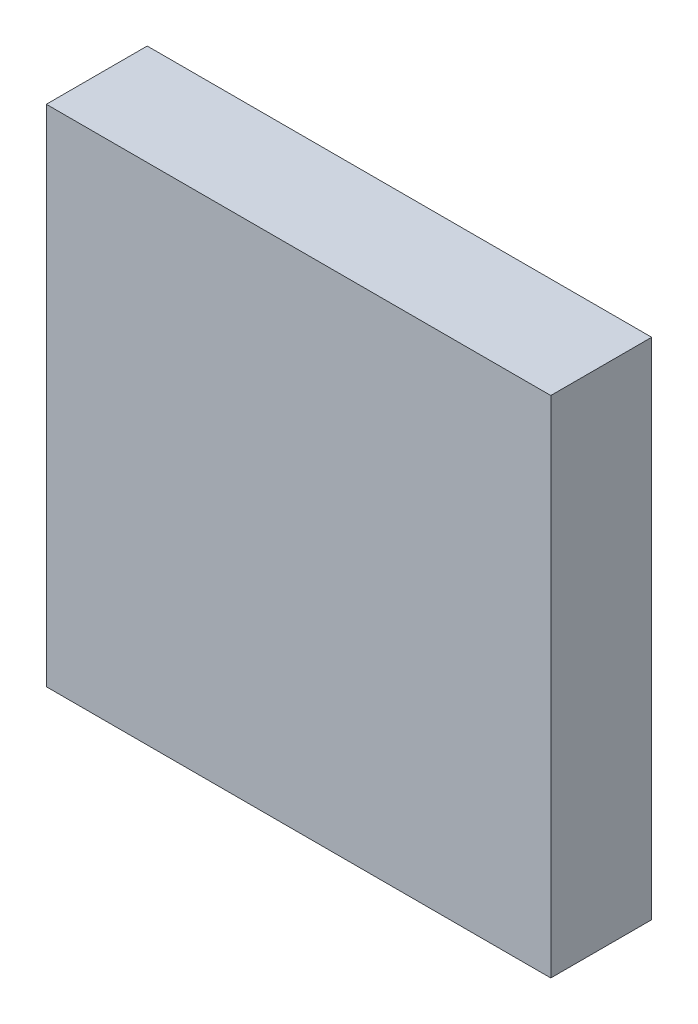
ISO-10303-21;
HEADER;
FILE_DESCRIPTION(('STEP AP214'),'2;1');
FILE_NAME('part.step','',(''),(''),'','','');
FILE_SCHEMA(('AUTOMOTIVE_DESIGN { 1 0 10303 214 1 1 1 1 }'));
ENDSEC;
DATA;
#1=APPLICATION_CONTEXT('core data for automotive mechanical design processes');
#2=APPLICATION_PROTOCOL_DEFINITION('international standard','automotive_design',2000,#1);
#3=PRODUCT_CONTEXT('',#1,'mechanical');
#4=PRODUCT('Part','Part','',(#3));
#5=PRODUCT_RELATED_PRODUCT_CATEGORY('part','',(#4));
#6=PRODUCT_DEFINITION_FORMATION('','',#4);
#7=PRODUCT_DEFINITION_CONTEXT('part definition',#1,'design');
#8=PRODUCT_DEFINITION('design','',#6,#7);
#9=PRODUCT_DEFINITION_SHAPE('','',#8);
#10=(LENGTH_UNIT() NAMED_UNIT(*) SI_UNIT(.MILLI.,.METRE.));
#11=(NAMED_UNIT(*) PLANE_ANGLE_UNIT() SI_UNIT($,.RADIAN.));
#12=(NAMED_UNIT(*) SI_UNIT($,.STERADIAN.) SOLID_ANGLE_UNIT());
#13=UNCERTAINTY_MEASURE_WITH_UNIT(LENGTH_MEASURE(1.E-05),#10,'distance_accuracy_value','');
#14=(GEOMETRIC_REPRESENTATION_CONTEXT(3) GLOBAL_UNCERTAINTY_ASSIGNED_CONTEXT((#13)) GLOBAL_UNIT_ASSIGNED_CONTEXT((#10,
#11,#12)) REPRESENTATION_CONTEXT('',''));
#15=CARTESIAN_POINT('',(0.,0.,0.));
#16=DIRECTION('',(0.,0.,1.));
#17=DIRECTION('',(1.,0.,0.));
#18=AXIS2_PLACEMENT_3D('',#15,#16,#17);
#19=CARTESIAN_POINT('',(-15.,15.,-5.));
#20=DIRECTION('',(-1.,0.,0.));
#21=DIRECTION('',(0.,-1.,0.));
#22=AXIS2_PLACEMENT_3D('',#19,#20,#21);
#23=PLANE('',#22);
#24=DIRECTION('',(0.,0.,1.));
#25=VECTOR('',#24,1.);
#26=CARTESIAN_POINT('',(-15.,-15.,-5.));
#27=LINE('',#26,#25);
#28=CARTESIAN_POINT('',(-15.,-15.,-5.));
#29=VERTEX_POINT('',#28);
#30=CARTESIAN_POINT('',(-15.,-15.,1.));
#31=VERTEX_POINT('',#30);
#32=EDGE_CURVE('E36',#29,#31,#27,.T.);
#33=ORIENTED_EDGE('',*,*,#32,.T.);
#34=DIRECTION('',(0.,-1.,0.));
#35=VECTOR('',#34,1.);
#36=CARTESIAN_POINT('',(-15.,15.,1.));
#37=LINE('',#36,#35);
#38=CARTESIAN_POINT('',(-15.,15.,1.));
#39=VERTEX_POINT('',#38);
#40=EDGE_CURVE('E86',#39,#31,#37,.T.);
#41=ORIENTED_EDGE('',*,*,#40,.F.);
#42=DIRECTION('',(0.,0.,1.));
#43=VECTOR('',#42,1.);
#44=CARTESIAN_POINT('',(-15.,15.,-5.));
#45=LINE('',#44,#43);
#46=CARTESIAN_POINT('',(-15.,15.,-5.));
#47=VERTEX_POINT('',#46);
#48=EDGE_CURVE('E11',#47,#39,#45,.T.);
#49=ORIENTED_EDGE('',*,*,#48,.F.);
#50=DIRECTION('',(0.,-1.,0.));
#51=VECTOR('',#50,1.);
#52=CARTESIAN_POINT('',(-15.,15.,-5.));
#53=LINE('',#52,#51);
#54=EDGE_CURVE('E102',#47,#29,#53,.T.);
#55=ORIENTED_EDGE('',*,*,#54,.T.);
#56=EDGE_LOOP('',(#33,#41,#49,#55));
#57=FACE_BOUND('',#56,.T.);
#58=ADVANCED_FACE('F33',(#57),#23,.T.);
#59=CARTESIAN_POINT('',(15.,15.,-5.));
#60=DIRECTION('',(0.,1.,0.));
#61=DIRECTION('',(0.,0.,1.));
#62=AXIS2_PLACEMENT_3D('',#59,#60,#61);
#63=PLANE('',#62);
#64=ORIENTED_EDGE('',*,*,#48,.T.);
#65=DIRECTION('',(-1.,0.,0.));
#66=VECTOR('',#65,1.);
#67=CARTESIAN_POINT('',(-15.,15.,1.));
#68=LINE('',#67,#66);
#69=CARTESIAN_POINT('',(15.,15.,1.));
#70=VERTEX_POINT('',#69);
#71=EDGE_CURVE('E82',#70,#39,#68,.T.);
#72=ORIENTED_EDGE('',*,*,#71,.F.);
#73=DIRECTION('',(0.,0.,1.));
#74=VECTOR('',#73,1.);
#75=CARTESIAN_POINT('',(15.,15.,-5.));
#76=LINE('',#75,#74);
#77=CARTESIAN_POINT('',(15.,15.,-5.));
#78=VERTEX_POINT('',#77);
#79=EDGE_CURVE('E41',#78,#70,#76,.T.);
#80=ORIENTED_EDGE('',*,*,#79,.F.);
#81=DIRECTION('',(-1.,0.,0.));
#82=VECTOR('',#81,1.);
#83=CARTESIAN_POINT('',(15.,15.,-5.));
#84=LINE('',#83,#82);
#85=EDGE_CURVE('E108',#78,#47,#84,.T.);
#86=ORIENTED_EDGE('',*,*,#85,.T.);
#87=EDGE_LOOP('',(#64,#72,#80,#86));
#88=FACE_BOUND('',#87,.T.);
#89=ADVANCED_FACE('F83',(#88),#63,.T.);
#90=CARTESIAN_POINT('',(15.,15.,-5.));
#91=DIRECTION('',(1.,0.,0.));
#92=DIRECTION('',(0.,1.,0.));
#93=AXIS2_PLACEMENT_3D('',#90,#91,#92);
#94=PLANE('',#93);
#95=ORIENTED_EDGE('',*,*,#79,.T.);
#96=DIRECTION('',(0.,1.,0.));
#97=VECTOR('',#96,1.);
#98=CARTESIAN_POINT('',(15.,15.,1.));
#99=LINE('',#98,#97);
#100=CARTESIAN_POINT('',(15.,-15.,1.));
#101=VERTEX_POINT('',#100);
#102=EDGE_CURVE('E75',#101,#70,#99,.T.);
#103=ORIENTED_EDGE('',*,*,#102,.F.);
#104=DIRECTION('',(0.,0.,1.));
#105=VECTOR('',#104,1.);
#106=CARTESIAN_POINT('',(15.,-15.,-5.));
#107=LINE('',#106,#105);
#108=CARTESIAN_POINT('',(15.,-15.,-5.));
#109=VERTEX_POINT('',#108);
#110=EDGE_CURVE('E79',#109,#101,#107,.T.);
#111=ORIENTED_EDGE('',*,*,#110,.F.);
#112=DIRECTION('',(0.,1.,0.));
#113=VECTOR('',#112,1.);
#114=CARTESIAN_POINT('',(15.,15.,-5.));
#115=LINE('',#114,#113);
#116=EDGE_CURVE('E77',#109,#78,#115,.T.);
#117=ORIENTED_EDGE('',*,*,#116,.T.);
#118=EDGE_LOOP('',(#95,#103,#111,#117));
#119=FACE_BOUND('',#118,.T.);
#120=ADVANCED_FACE('F73',(#119),#94,.T.);
#121=CARTESIAN_POINT('',(15.,-15.,-5.));
#122=DIRECTION('',(0.,-1.,0.));
#123=DIRECTION('',(0.,0.,-1.));
#124=AXIS2_PLACEMENT_3D('',#121,#122,#123);
#125=PLANE('',#124);
#126=ORIENTED_EDGE('',*,*,#110,.T.);
#127=DIRECTION('',(1.,0.,0.));
#128=VECTOR('',#127,1.);
#129=CARTESIAN_POINT('',(-15.,-15.,1.));
#130=LINE('',#129,#128);
#131=EDGE_CURVE('E91',#31,#101,#130,.T.);
#132=ORIENTED_EDGE('',*,*,#131,.F.);
#133=ORIENTED_EDGE('',*,*,#32,.F.);
#134=DIRECTION('',(1.,0.,0.));
#135=VECTOR('',#134,1.);
#136=CARTESIAN_POINT('',(15.,-15.,-5.));
#137=LINE('',#136,#135);
#138=EDGE_CURVE('E104',#29,#109,#137,.T.);
#139=ORIENTED_EDGE('',*,*,#138,.T.);
#140=EDGE_LOOP('',(#126,#132,#133,#139));
#141=FACE_BOUND('',#140,.T.);
#142=ADVANCED_FACE('F111',(#141),#125,.T.);
#143=CARTESIAN_POINT('',(0.,0.,-5.));
#144=DIRECTION('',(0.,0.,-1.));
#145=DIRECTION('',(-1.,0.,0.));
#146=AXIS2_PLACEMENT_3D('',#143,#144,#145);
#147=PLANE('',#146);
#148=CARTESIAN_POINT('',(0.,0.,-5.));
#149=DIRECTION('',(0.,0.,1.));
#150=DIRECTION('',(1.,0.,0.));
#151=AXIS2_PLACEMENT_3D('',#148,#149,#150);
#152=CIRCLE('',#151,12.55);
#153=CARTESIAN_POINT('',(12.55,0.,-5.));
#154=VERTEX_POINT('',#153);
#155=EDGE_CURVE('E99',#154,#154,#152,.T.);
#156=ORIENTED_EDGE('',*,*,#155,.T.);
#157=EDGE_LOOP('',(#156));
#158=FACE_BOUND('',#157,.T.);
#159=ORIENTED_EDGE('',*,*,#54,.F.);
#160=ORIENTED_EDGE('',*,*,#85,.F.);
#161=ORIENTED_EDGE('',*,*,#116,.F.);
#162=ORIENTED_EDGE('',*,*,#138,.F.);
#163=EDGE_LOOP('',(#159,#160,#161,#162));
#164=FACE_BOUND('',#163,.T.);
#165=ADVANCED_FACE('F113',(#158,#164),#147,.T.);
#166=CARTESIAN_POINT('',(0.,0.,-5.));
#167=DIRECTION('',(0.,0.,1.));
#168=DIRECTION('',(1.,0.,0.));
#169=AXIS2_PLACEMENT_3D('',#166,#167,#168);
#170=CYLINDRICAL_SURFACE('',#169,12.55);
#171=ORIENTED_EDGE('',*,*,#155,.F.);
#172=EDGE_LOOP('',(#171));
#173=FACE_BOUND('',#172,.T.);
#174=CARTESIAN_POINT('',(0.,0.,0.));
#175=DIRECTION('',(0.,0.,1.));
#176=DIRECTION('',(1.,0.,0.));
#177=AXIS2_PLACEMENT_3D('',#174,#175,#176);
#178=CIRCLE('',#177,12.55);
#179=CARTESIAN_POINT('',(12.55,0.,0.));
#180=VERTEX_POINT('',#179);
#181=EDGE_CURVE('E96',#180,#180,#178,.F.);
#182=ORIENTED_EDGE('',*,*,#181,.F.);
#183=EDGE_LOOP('',(#182));
#184=FACE_BOUND('',#183,.T.);
#185=ADVANCED_FACE('F118',(#173,#184),#170,.F.);
#186=CARTESIAN_POINT('',(0.,0.,0.));
#187=DIRECTION('',(0.,0.,1.));
#188=DIRECTION('',(1.,0.,0.));
#189=AXIS2_PLACEMENT_3D('',#186,#187,#188);
#190=PLANE('',#189);
#191=ORIENTED_EDGE('',*,*,#181,.T.);
#192=EDGE_LOOP('',(#191));
#193=FACE_BOUND('',#192,.T.);
#194=ADVANCED_FACE('F132',(#193),#190,.F.);
#195=CARTESIAN_POINT('',(0.,0.,1.));
#196=DIRECTION('',(0.,0.,1.));
#197=DIRECTION('',(1.,0.,0.));
#198=AXIS2_PLACEMENT_3D('',#195,#196,#197);
#199=PLANE('',#198);
#200=ORIENTED_EDGE('',*,*,#102,.T.);
#201=ORIENTED_EDGE('',*,*,#71,.T.);
#202=ORIENTED_EDGE('',*,*,#40,.T.);
#203=ORIENTED_EDGE('',*,*,#131,.T.);
#204=EDGE_LOOP('',(#200,#201,#202,#203));
#205=FACE_BOUND('',#204,.T.);
#206=ADVANCED_FACE('F89',(#205),#199,.T.);
#207=CLOSED_SHELL('',(#58,#89,#120,#142,#165,#185,#194,#206));
#208=MANIFOLD_SOLID_BREP('B2',#207);
#209=ADVANCED_BREP_SHAPE_REPRESENTATION('',(#18,#208),#14);
#210=SHAPE_DEFINITION_REPRESENTATION(#9,#209);
ENDSEC;
END-ISO-10303-21;
